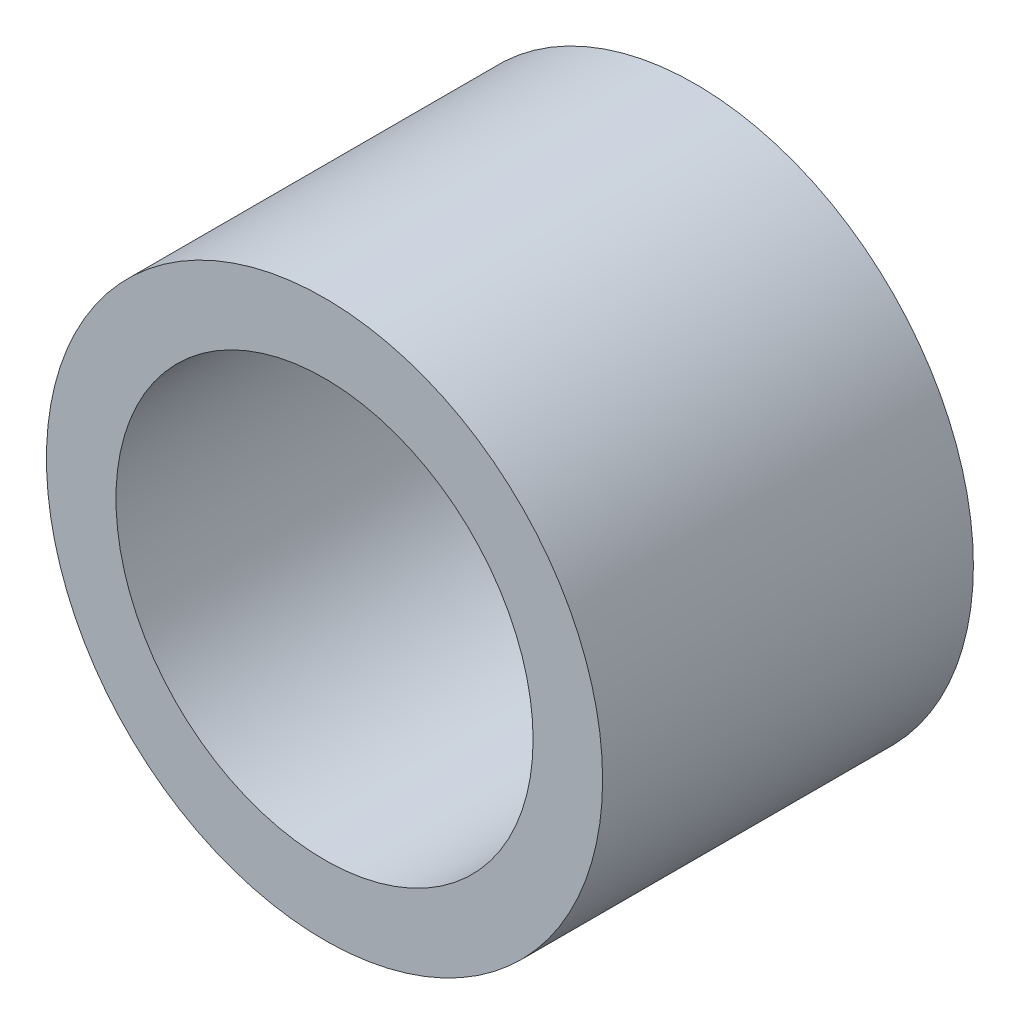
ISO-10303-21;
HEADER;
FILE_DESCRIPTION(('STEP AP214'),'2;1');
FILE_NAME('part.step','',(''),(''),'','','');
FILE_SCHEMA(('AUTOMOTIVE_DESIGN { 1 0 10303 214 1 1 1 1 }'));
ENDSEC;
DATA;
#1=APPLICATION_CONTEXT('core data for automotive mechanical design processes');
#2=APPLICATION_PROTOCOL_DEFINITION('international standard','automotive_design',2000,#1);
#3=PRODUCT_CONTEXT('',#1,'mechanical');
#4=PRODUCT('Part','Part','',(#3));
#5=PRODUCT_RELATED_PRODUCT_CATEGORY('part','',(#4));
#6=PRODUCT_DEFINITION_FORMATION('','',#4);
#7=PRODUCT_DEFINITION_CONTEXT('part definition',#1,'design');
#8=PRODUCT_DEFINITION('design','',#6,#7);
#9=PRODUCT_DEFINITION_SHAPE('','',#8);
#10=(LENGTH_UNIT() NAMED_UNIT(*) SI_UNIT(.MILLI.,.METRE.));
#11=(NAMED_UNIT(*) PLANE_ANGLE_UNIT() SI_UNIT($,.RADIAN.));
#12=(NAMED_UNIT(*) SI_UNIT($,.STERADIAN.) SOLID_ANGLE_UNIT());
#13=UNCERTAINTY_MEASURE_WITH_UNIT(LENGTH_MEASURE(1.E-05),#10,'distance_accuracy_value','');
#14=(GEOMETRIC_REPRESENTATION_CONTEXT(3) GLOBAL_UNCERTAINTY_ASSIGNED_CONTEXT((#13)) GLOBAL_UNIT_ASSIGNED_CONTEXT((#10,
#11,#12)) REPRESENTATION_CONTEXT('',''));
#15=CARTESIAN_POINT('',(0.,0.,0.));
#16=DIRECTION('',(0.,0.,1.));
#17=DIRECTION('',(1.,0.,0.));
#18=AXIS2_PLACEMENT_3D('',#15,#16,#17);
#19=CARTESIAN_POINT('',(0.,0.,4.));
#20=DIRECTION('',(0.,0.,1.));
#21=DIRECTION('',(1.,0.,0.));
#22=AXIS2_PLACEMENT_3D('',#19,#20,#21);
#23=PLANE('',#22);
#24=CARTESIAN_POINT('',(0.,0.,4.));
#25=DIRECTION('',(0.,0.,1.));
#26=DIRECTION('',(1.,0.,0.));
#27=AXIS2_PLACEMENT_3D('',#24,#25,#26);
#28=CIRCLE('',#27,6.);
#29=CARTESIAN_POINT('',(6.,0.,4.));
#30=VERTEX_POINT('',#29);
#31=EDGE_CURVE('E10',#30,#30,#28,.T.);
#32=ORIENTED_EDGE('',*,*,#31,.T.);
#33=EDGE_LOOP('',(#32));
#34=FACE_BOUND('',#33,.T.);
#35=CARTESIAN_POINT('',(0.,0.,4.));
#36=DIRECTION('',(0.,0.,1.));
#37=DIRECTION('',(1.,0.,0.));
#38=AXIS2_PLACEMENT_3D('',#35,#36,#37);
#39=CIRCLE('',#38,4.5);
#40=CARTESIAN_POINT('',(4.5,0.,4.));
#41=VERTEX_POINT('',#40);
#42=EDGE_CURVE('E45',#41,#41,#39,.T.);
#43=ORIENTED_EDGE('',*,*,#42,.F.);
#44=EDGE_LOOP('',(#43));
#45=FACE_BOUND('',#44,.T.);
#46=ADVANCED_FACE('F34',(#34,#45),#23,.T.);
#47=CARTESIAN_POINT('',(0.,0.,-4.));
#48=DIRECTION('',(0.,0.,1.));
#49=DIRECTION('',(1.,0.,0.));
#50=AXIS2_PLACEMENT_3D('',#47,#48,#49);
#51=PLANE('',#50);
#52=CARTESIAN_POINT('',(0.,0.,-4.));
#53=DIRECTION('',(0.,0.,1.));
#54=DIRECTION('',(1.,0.,0.));
#55=AXIS2_PLACEMENT_3D('',#52,#53,#54);
#56=CIRCLE('',#55,6.);
#57=CARTESIAN_POINT('',(6.,0.,-4.));
#58=VERTEX_POINT('',#57);
#59=EDGE_CURVE('E38',#58,#58,#56,.T.);
#60=ORIENTED_EDGE('',*,*,#59,.F.);
#61=EDGE_LOOP('',(#60));
#62=FACE_BOUND('',#61,.T.);
#63=CARTESIAN_POINT('',(0.,0.,-4.));
#64=DIRECTION('',(0.,0.,1.));
#65=DIRECTION('',(1.,0.,0.));
#66=AXIS2_PLACEMENT_3D('',#63,#64,#65);
#67=CIRCLE('',#66,4.5);
#68=CARTESIAN_POINT('',(4.5,0.,-4.));
#69=VERTEX_POINT('',#68);
#70=EDGE_CURVE('E47',#69,#69,#67,.T.);
#71=ORIENTED_EDGE('',*,*,#70,.T.);
#72=EDGE_LOOP('',(#71));
#73=FACE_BOUND('',#72,.T.);
#74=ADVANCED_FACE('F57',(#62,#73),#51,.F.);
#75=CARTESIAN_POINT('',(0.,0.,4.));
#76=DIRECTION('',(0.,0.,-1.));
#77=DIRECTION('',(-1.,0.,0.));
#78=AXIS2_PLACEMENT_3D('',#75,#76,#77);
#79=CYLINDRICAL_SURFACE('',#78,6.);
#80=ORIENTED_EDGE('',*,*,#31,.F.);
#81=EDGE_LOOP('',(#80));
#82=FACE_BOUND('',#81,.T.);
#83=ORIENTED_EDGE('',*,*,#59,.T.);
#84=EDGE_LOOP('',(#83));
#85=FACE_BOUND('',#84,.T.);
#86=ADVANCED_FACE('F36',(#82,#85),#79,.T.);
#87=CARTESIAN_POINT('',(0.,0.,4.));
#88=DIRECTION('',(0.,0.,-1.));
#89=DIRECTION('',(-1.,0.,0.));
#90=AXIS2_PLACEMENT_3D('',#87,#88,#89);
#91=CYLINDRICAL_SURFACE('',#90,4.5);
#92=ORIENTED_EDGE('',*,*,#42,.T.);
#93=EDGE_LOOP('',(#92));
#94=FACE_BOUND('',#93,.T.);
#95=ORIENTED_EDGE('',*,*,#70,.F.);
#96=EDGE_LOOP('',(#95));
#97=FACE_BOUND('',#96,.T.);
#98=ADVANCED_FACE('F53',(#94,#97),#91,.F.);
#99=CLOSED_SHELL('',(#46,#74,#86,#98));
#100=MANIFOLD_SOLID_BREP('B2',#99);
#101=ADVANCED_BREP_SHAPE_REPRESENTATION('',(#18,#100),#14);
#102=SHAPE_DEFINITION_REPRESENTATION(#9,#101);
ENDSEC;
END-ISO-10303-21;
